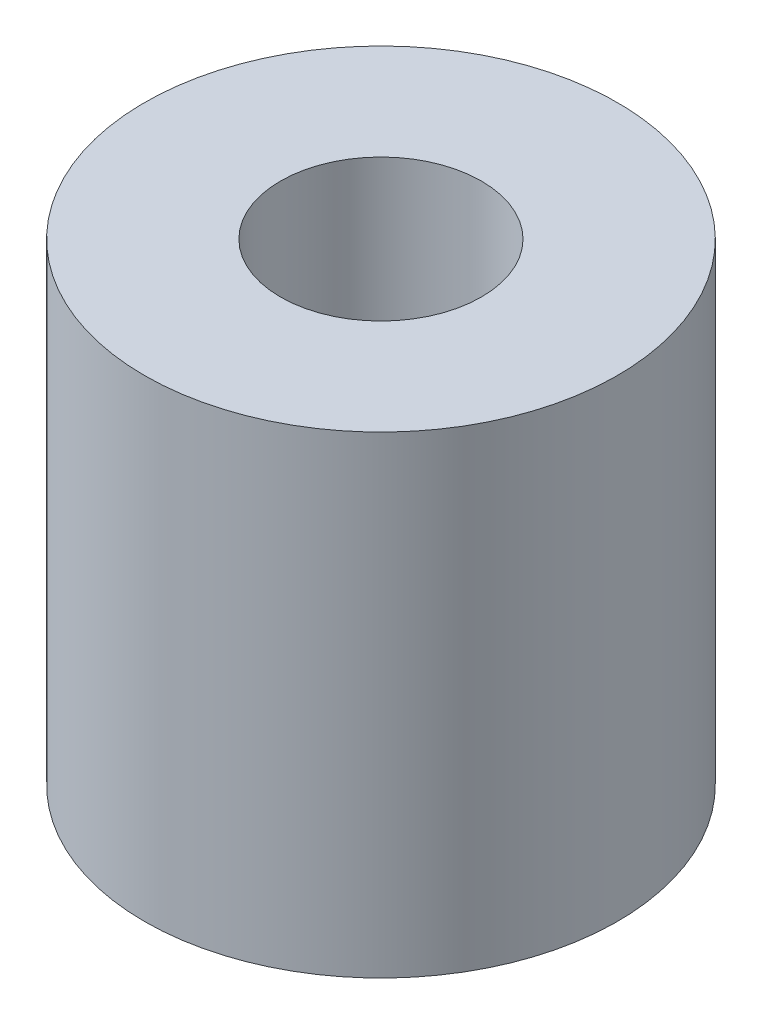
ISO-10303-21;
HEADER;
FILE_DESCRIPTION(('STEP AP214'),'2;1');
FILE_NAME('part.step','',(''),(''),'','','');
FILE_SCHEMA(('AUTOMOTIVE_DESIGN { 1 0 10303 214 1 1 1 1 }'));
ENDSEC;
DATA;
#1=APPLICATION_CONTEXT('core data for automotive mechanical design processes');
#2=APPLICATION_PROTOCOL_DEFINITION('international standard','automotive_design',2000,#1);
#3=PRODUCT_CONTEXT('',#1,'mechanical');
#4=PRODUCT('Part','Part','',(#3));
#5=PRODUCT_RELATED_PRODUCT_CATEGORY('part','',(#4));
#6=PRODUCT_DEFINITION_FORMATION('','',#4);
#7=PRODUCT_DEFINITION_CONTEXT('part definition',#1,'design');
#8=PRODUCT_DEFINITION('design','',#6,#7);
#9=PRODUCT_DEFINITION_SHAPE('','',#8);
#10=(LENGTH_UNIT() NAMED_UNIT(*) SI_UNIT(.MILLI.,.METRE.));
#11=(NAMED_UNIT(*) PLANE_ANGLE_UNIT() SI_UNIT($,.RADIAN.));
#12=(NAMED_UNIT(*) SI_UNIT($,.STERADIAN.) SOLID_ANGLE_UNIT());
#13=UNCERTAINTY_MEASURE_WITH_UNIT(LENGTH_MEASURE(1.E-05),#10,'distance_accuracy_value','');
#14=(GEOMETRIC_REPRESENTATION_CONTEXT(3) GLOBAL_UNCERTAINTY_ASSIGNED_CONTEXT((#13)) GLOBAL_UNIT_ASSIGNED_CONTEXT((#10,
#11,#12)) REPRESENTATION_CONTEXT('',''));
#15=CARTESIAN_POINT('',(0.,0.,0.));
#16=DIRECTION('',(0.,0.,1.));
#17=DIRECTION('',(1.,0.,0.));
#18=AXIS2_PLACEMENT_3D('',#15,#16,#17);
#19=CARTESIAN_POINT('',(0.,10.,0.));
#20=DIRECTION('',(0.,1.,0.));
#21=DIRECTION('',(0.,0.,1.));
#22=AXIS2_PLACEMENT_3D('',#19,#20,#21);
#23=PLANE('',#22);
#24=CARTESIAN_POINT('',(0.,10.,0.));
#25=DIRECTION('',(0.,1.,0.));
#26=DIRECTION('',(0.,0.,1.));
#27=AXIS2_PLACEMENT_3D('',#24,#25,#26);
#28=CIRCLE('',#27,5.);
#29=CARTESIAN_POINT('',(0.,10.,5.));
#30=VERTEX_POINT('',#29);
#31=EDGE_CURVE('E10',#30,#30,#28,.T.);
#32=ORIENTED_EDGE('',*,*,#31,.T.);
#33=EDGE_LOOP('',(#32));
#34=FACE_BOUND('',#33,.T.);
#35=CARTESIAN_POINT('',(0.,10.,0.));
#36=DIRECTION('',(0.,1.,0.));
#37=DIRECTION('',(0.,0.,1.));
#38=AXIS2_PLACEMENT_3D('',#35,#36,#37);
#39=CIRCLE('',#38,2.125);
#40=CARTESIAN_POINT('',(0.,10.,2.125));
#41=VERTEX_POINT('',#40);
#42=EDGE_CURVE('E42',#41,#41,#39,.T.);
#43=ORIENTED_EDGE('',*,*,#42,.F.);
#44=EDGE_LOOP('',(#43));
#45=FACE_BOUND('',#44,.T.);
#46=ADVANCED_FACE('F31',(#34,#45),#23,.T.);
#47=CARTESIAN_POINT('',(0.,0.,0.));
#48=DIRECTION('',(0.,1.,0.));
#49=DIRECTION('',(0.,0.,1.));
#50=AXIS2_PLACEMENT_3D('',#47,#48,#49);
#51=PLANE('',#50);
#52=CARTESIAN_POINT('',(0.,0.,0.));
#53=DIRECTION('',(0.,1.,0.));
#54=DIRECTION('',(0.,0.,1.));
#55=AXIS2_PLACEMENT_3D('',#52,#53,#54);
#56=CIRCLE('',#55,5.);
#57=CARTESIAN_POINT('',(0.,0.,5.));
#58=VERTEX_POINT('',#57);
#59=EDGE_CURVE('E35',#58,#58,#56,.T.);
#60=ORIENTED_EDGE('',*,*,#59,.F.);
#61=EDGE_LOOP('',(#60));
#62=FACE_BOUND('',#61,.T.);
#63=CARTESIAN_POINT('',(0.,0.,0.));
#64=DIRECTION('',(0.,1.,0.));
#65=DIRECTION('',(0.,0.,1.));
#66=AXIS2_PLACEMENT_3D('',#63,#64,#65);
#67=CIRCLE('',#66,2.125);
#68=CARTESIAN_POINT('',(0.,0.,2.125));
#69=VERTEX_POINT('',#68);
#70=EDGE_CURVE('E44',#69,#69,#67,.T.);
#71=ORIENTED_EDGE('',*,*,#70,.T.);
#72=EDGE_LOOP('',(#71));
#73=FACE_BOUND('',#72,.T.);
#74=ADVANCED_FACE('F54',(#62,#73),#51,.F.);
#75=CARTESIAN_POINT('',(0.,10.,0.));
#76=DIRECTION('',(0.,-1.,0.));
#77=DIRECTION('',(0.,0.,-1.));
#78=AXIS2_PLACEMENT_3D('',#75,#76,#77);
#79=CYLINDRICAL_SURFACE('',#78,5.);
#80=ORIENTED_EDGE('',*,*,#31,.F.);
#81=EDGE_LOOP('',(#80));
#82=FACE_BOUND('',#81,.T.);
#83=ORIENTED_EDGE('',*,*,#59,.T.);
#84=EDGE_LOOP('',(#83));
#85=FACE_BOUND('',#84,.T.);
#86=ADVANCED_FACE('F33',(#82,#85),#79,.T.);
#87=CARTESIAN_POINT('',(0.,10.,0.));
#88=DIRECTION('',(0.,-1.,0.));
#89=DIRECTION('',(0.,0.,-1.));
#90=AXIS2_PLACEMENT_3D('',#87,#88,#89);
#91=CYLINDRICAL_SURFACE('',#90,2.125);
#92=ORIENTED_EDGE('',*,*,#42,.T.);
#93=EDGE_LOOP('',(#92));
#94=FACE_BOUND('',#93,.T.);
#95=ORIENTED_EDGE('',*,*,#70,.F.);
#96=EDGE_LOOP('',(#95));
#97=FACE_BOUND('',#96,.T.);
#98=ADVANCED_FACE('F50',(#94,#97),#91,.F.);
#99=CLOSED_SHELL('',(#46,#74,#86,#98));
#100=MANIFOLD_SOLID_BREP('B2',#99);
#101=ADVANCED_BREP_SHAPE_REPRESENTATION('',(#18,#100),#14);
#102=SHAPE_DEFINITION_REPRESENTATION(#9,#101);
ENDSEC;
END-ISO-10303-21;
